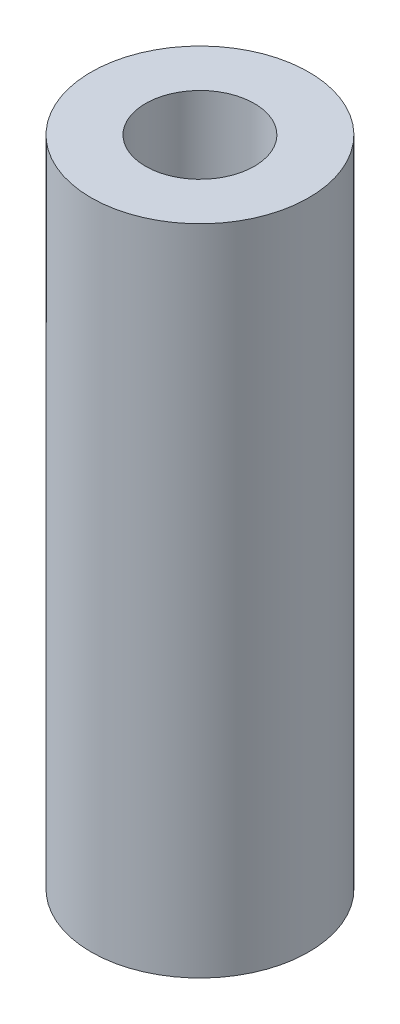
ISO-10303-21;
HEADER;
FILE_DESCRIPTION(('STEP AP214'),'2;1');
FILE_NAME('part.step','',(''),(''),'','','');
FILE_SCHEMA(('AUTOMOTIVE_DESIGN { 1 0 10303 214 1 1 1 1 }'));
ENDSEC;
DATA;
#1=APPLICATION_CONTEXT('core data for automotive mechanical design processes');
#2=APPLICATION_PROTOCOL_DEFINITION('international standard','automotive_design',2000,#1);
#3=PRODUCT_CONTEXT('',#1,'mechanical');
#4=PRODUCT('Part','Part','',(#3));
#5=PRODUCT_RELATED_PRODUCT_CATEGORY('part','',(#4));
#6=PRODUCT_DEFINITION_FORMATION('','',#4);
#7=PRODUCT_DEFINITION_CONTEXT('part definition',#1,'design');
#8=PRODUCT_DEFINITION('design','',#6,#7);
#9=PRODUCT_DEFINITION_SHAPE('','',#8);
#10=(LENGTH_UNIT() NAMED_UNIT(*) SI_UNIT(.MILLI.,.METRE.));
#11=(NAMED_UNIT(*) PLANE_ANGLE_UNIT() SI_UNIT($,.RADIAN.));
#12=(NAMED_UNIT(*) SI_UNIT($,.STERADIAN.) SOLID_ANGLE_UNIT());
#13=UNCERTAINTY_MEASURE_WITH_UNIT(LENGTH_MEASURE(1.E-05),#10,'distance_accuracy_value','');
#14=(GEOMETRIC_REPRESENTATION_CONTEXT(3) GLOBAL_UNCERTAINTY_ASSIGNED_CONTEXT((#13)) GLOBAL_UNIT_ASSIGNED_CONTEXT((#10,
#11,#12)) REPRESENTATION_CONTEXT('',''));
#15=CARTESIAN_POINT('',(0.,0.,0.));
#16=DIRECTION('',(0.,0.,1.));
#17=DIRECTION('',(1.,0.,0.));
#18=AXIS2_PLACEMENT_3D('',#15,#16,#17);
#19=CARTESIAN_POINT('',(0.,30.,0.));
#20=DIRECTION('',(0.,1.,0.));
#21=DIRECTION('',(0.,0.,1.));
#22=AXIS2_PLACEMENT_3D('',#19,#20,#21);
#23=PLANE('',#22);
#24=CARTESIAN_POINT('',(0.,30.,0.));
#25=DIRECTION('',(0.,1.,0.));
#26=DIRECTION('',(0.,0.,1.));
#27=AXIS2_PLACEMENT_3D('',#24,#25,#26);
#28=CIRCLE('',#27,5.);
#29=CARTESIAN_POINT('',(0.,30.,5.));
#30=VERTEX_POINT('',#29);
#31=EDGE_CURVE('E10',#30,#30,#28,.T.);
#32=ORIENTED_EDGE('',*,*,#31,.T.);
#33=EDGE_LOOP('',(#32));
#34=FACE_BOUND('',#33,.T.);
#35=CARTESIAN_POINT('',(0.,30.,0.));
#36=DIRECTION('',(0.,1.,0.));
#37=DIRECTION('',(0.,0.,1.));
#38=AXIS2_PLACEMENT_3D('',#35,#36,#37);
#39=CIRCLE('',#38,2.5);
#40=CARTESIAN_POINT('',(0.,30.,2.5));
#41=VERTEX_POINT('',#40);
#42=EDGE_CURVE('E43',#41,#41,#39,.T.);
#43=ORIENTED_EDGE('',*,*,#42,.F.);
#44=EDGE_LOOP('',(#43));
#45=FACE_BOUND('',#44,.T.);
#46=ADVANCED_FACE('F32',(#34,#45),#23,.T.);
#47=CARTESIAN_POINT('',(0.,0.,0.));
#48=DIRECTION('',(0.,1.,0.));
#49=DIRECTION('',(0.,0.,1.));
#50=AXIS2_PLACEMENT_3D('',#47,#48,#49);
#51=PLANE('',#50);
#52=CARTESIAN_POINT('',(0.,0.,0.));
#53=DIRECTION('',(0.,1.,0.));
#54=DIRECTION('',(0.,0.,1.));
#55=AXIS2_PLACEMENT_3D('',#52,#53,#54);
#56=CIRCLE('',#55,5.);
#57=CARTESIAN_POINT('',(0.,0.,5.));
#58=VERTEX_POINT('',#57);
#59=EDGE_CURVE('E36',#58,#58,#56,.T.);
#60=ORIENTED_EDGE('',*,*,#59,.F.);
#61=EDGE_LOOP('',(#60));
#62=FACE_BOUND('',#61,.T.);
#63=CARTESIAN_POINT('',(0.,0.,0.));
#64=DIRECTION('',(0.,1.,0.));
#65=DIRECTION('',(0.,0.,1.));
#66=AXIS2_PLACEMENT_3D('',#63,#64,#65);
#67=CIRCLE('',#66,2.5);
#68=CARTESIAN_POINT('',(0.,0.,2.5));
#69=VERTEX_POINT('',#68);
#70=EDGE_CURVE('E45',#69,#69,#67,.T.);
#71=ORIENTED_EDGE('',*,*,#70,.T.);
#72=EDGE_LOOP('',(#71));
#73=FACE_BOUND('',#72,.T.);
#74=ADVANCED_FACE('F55',(#62,#73),#51,.F.);
#75=CARTESIAN_POINT('',(0.,30.,0.));
#76=DIRECTION('',(0.,-1.,0.));
#77=DIRECTION('',(0.,0.,-1.));
#78=AXIS2_PLACEMENT_3D('',#75,#76,#77);
#79=CYLINDRICAL_SURFACE('',#78,5.);
#80=ORIENTED_EDGE('',*,*,#31,.F.);
#81=EDGE_LOOP('',(#80));
#82=FACE_BOUND('',#81,.T.);
#83=ORIENTED_EDGE('',*,*,#59,.T.);
#84=EDGE_LOOP('',(#83));
#85=FACE_BOUND('',#84,.T.);
#86=ADVANCED_FACE('F34',(#82,#85),#79,.T.);
#87=CARTESIAN_POINT('',(0.,30.,0.));
#88=DIRECTION('',(0.,-1.,0.));
#89=DIRECTION('',(0.,0.,-1.));
#90=AXIS2_PLACEMENT_3D('',#87,#88,#89);
#91=CYLINDRICAL_SURFACE('',#90,2.5);
#92=ORIENTED_EDGE('',*,*,#42,.T.);
#93=EDGE_LOOP('',(#92));
#94=FACE_BOUND('',#93,.T.);
#95=ORIENTED_EDGE('',*,*,#70,.F.);
#96=EDGE_LOOP('',(#95));
#97=FACE_BOUND('',#96,.T.);
#98=ADVANCED_FACE('F51',(#94,#97),#91,.F.);
#99=CLOSED_SHELL('',(#46,#74,#86,#98));
#100=MANIFOLD_SOLID_BREP('B2',#99);
#101=ADVANCED_BREP_SHAPE_REPRESENTATION('',(#18,#100),#14);
#102=SHAPE_DEFINITION_REPRESENTATION(#9,#101);
ENDSEC;
END-ISO-10303-21;
